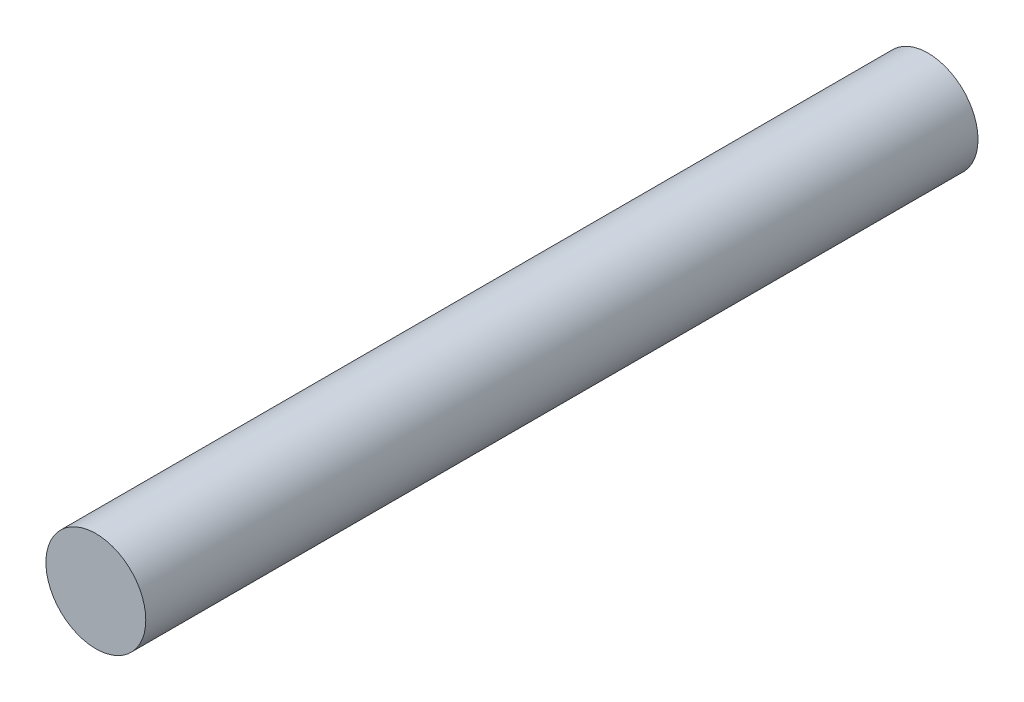
ISO-10303-21;
HEADER;
FILE_DESCRIPTION(('STEP AP214'),'2;1');
FILE_NAME('part.step','',(''),(''),'','','');
FILE_SCHEMA(('AUTOMOTIVE_DESIGN { 1 0 10303 214 1 1 1 1 }'));
ENDSEC;
DATA;
#1=APPLICATION_CONTEXT('core data for automotive mechanical design processes');
#2=APPLICATION_PROTOCOL_DEFINITION('international standard','automotive_design',2000,#1);
#3=PRODUCT_CONTEXT('',#1,'mechanical');
#4=PRODUCT('Part','Part','',(#3));
#5=PRODUCT_RELATED_PRODUCT_CATEGORY('part','',(#4));
#6=PRODUCT_DEFINITION_FORMATION('','',#4);
#7=PRODUCT_DEFINITION_CONTEXT('part definition',#1,'design');
#8=PRODUCT_DEFINITION('design','',#6,#7);
#9=PRODUCT_DEFINITION_SHAPE('','',#8);
#10=(LENGTH_UNIT() NAMED_UNIT(*) SI_UNIT(.MILLI.,.METRE.));
#11=(NAMED_UNIT(*) PLANE_ANGLE_UNIT() SI_UNIT($,.RADIAN.));
#12=(NAMED_UNIT(*) SI_UNIT($,.STERADIAN.) SOLID_ANGLE_UNIT());
#13=UNCERTAINTY_MEASURE_WITH_UNIT(LENGTH_MEASURE(1.E-05),#10,'distance_accuracy_value','');
#14=(GEOMETRIC_REPRESENTATION_CONTEXT(3) GLOBAL_UNCERTAINTY_ASSIGNED_CONTEXT((#13)) GLOBAL_UNIT_ASSIGNED_CONTEXT((#10,
#11,#12)) REPRESENTATION_CONTEXT('',''));
#15=CARTESIAN_POINT('',(0.,0.,0.));
#16=DIRECTION('',(0.,0.,1.));
#17=DIRECTION('',(1.,0.,0.));
#18=AXIS2_PLACEMENT_3D('',#15,#16,#17);
#19=CARTESIAN_POINT('',(0.,0.,-25.));
#20=DIRECTION('',(0.,0.,1.));
#21=DIRECTION('',(1.,0.,0.));
#22=AXIS2_PLACEMENT_3D('',#19,#20,#21);
#23=CYLINDRICAL_SURFACE('',#22,1.5);
#24=CARTESIAN_POINT('',(0.,0.,-25.));
#25=DIRECTION('',(0.,0.,1.));
#26=DIRECTION('',(1.,0.,0.));
#27=AXIS2_PLACEMENT_3D('',#24,#25,#26);
#28=CIRCLE('',#27,1.5);
#29=CARTESIAN_POINT('',(1.5,0.,-25.));
#30=VERTEX_POINT('',#29);
#31=EDGE_CURVE('E10',#30,#30,#28,.T.);
#32=ORIENTED_EDGE('',*,*,#31,.T.);
#33=EDGE_LOOP('',(#32));
#34=FACE_BOUND('',#33,.T.);
#35=CARTESIAN_POINT('',(0.,0.,0.));
#36=DIRECTION('',(0.,0.,1.));
#37=DIRECTION('',(1.,0.,0.));
#38=AXIS2_PLACEMENT_3D('',#35,#36,#37);
#39=CIRCLE('',#38,1.5);
#40=CARTESIAN_POINT('',(1.5,0.,0.));
#41=VERTEX_POINT('',#40);
#42=EDGE_CURVE('E34',#41,#41,#39,.T.);
#43=ORIENTED_EDGE('',*,*,#42,.F.);
#44=EDGE_LOOP('',(#43));
#45=FACE_BOUND('',#44,.T.);
#46=ADVANCED_FACE('F31',(#34,#45),#23,.T.);
#47=CARTESIAN_POINT('',(0.,0.,-25.));
#48=DIRECTION('',(0.,0.,1.));
#49=DIRECTION('',(1.,0.,0.));
#50=AXIS2_PLACEMENT_3D('',#47,#48,#49);
#51=PLANE('',#50);
#52=ORIENTED_EDGE('',*,*,#31,.F.);
#53=EDGE_LOOP('',(#52));
#54=FACE_BOUND('',#53,.T.);
#55=ADVANCED_FACE('F46',(#54),#51,.F.);
#56=CARTESIAN_POINT('',(0.,0.,0.));
#57=DIRECTION('',(0.,0.,1.));
#58=DIRECTION('',(1.,0.,0.));
#59=AXIS2_PLACEMENT_3D('',#56,#57,#58);
#60=PLANE('',#59);
#61=ORIENTED_EDGE('',*,*,#42,.T.);
#62=EDGE_LOOP('',(#61));
#63=FACE_BOUND('',#62,.T.);
#64=ADVANCED_FACE('F43',(#63),#60,.T.);
#65=CLOSED_SHELL('',(#46,#55,#64));
#66=MANIFOLD_SOLID_BREP('B2',#65);
#67=ADVANCED_BREP_SHAPE_REPRESENTATION('',(#18,#66),#14);
#68=SHAPE_DEFINITION_REPRESENTATION(#9,#67);
ENDSEC;
END-ISO-10303-21;
